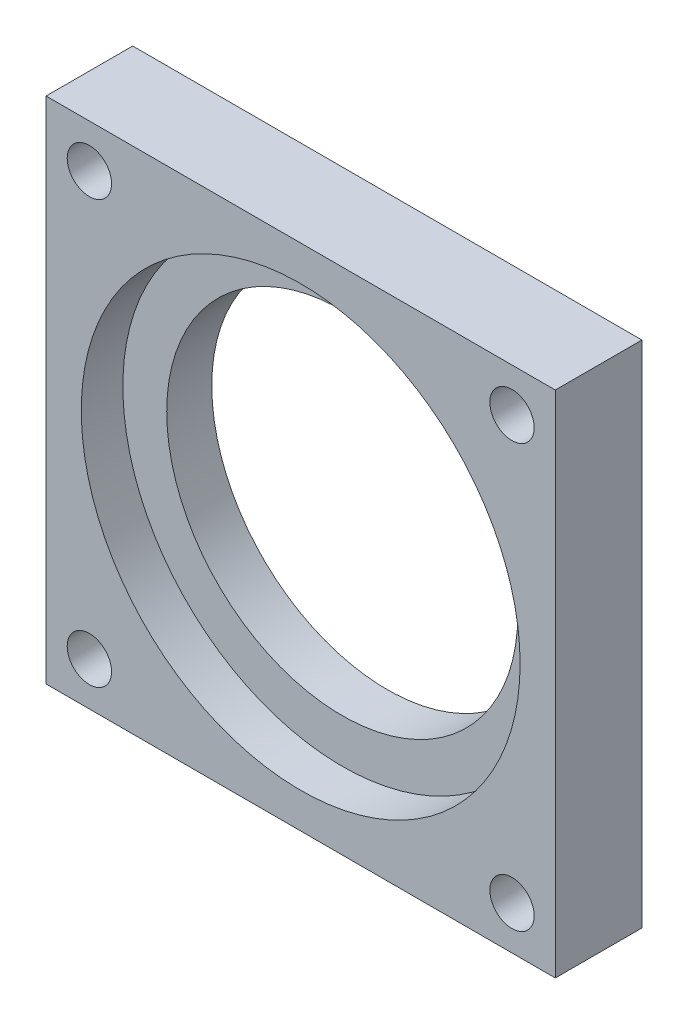
ISO-10303-21;
HEADER;
FILE_DESCRIPTION(('STEP AP214'),'2;1');
FILE_NAME('part.step','',(''),(''),'','','');
FILE_SCHEMA(('AUTOMOTIVE_DESIGN { 1 0 10303 214 1 1 1 1 }'));
ENDSEC;
DATA;
#1=APPLICATION_CONTEXT('core data for automotive mechanical design processes');
#2=APPLICATION_PROTOCOL_DEFINITION('international standard','automotive_design',2000,#1);
#3=PRODUCT_CONTEXT('',#1,'mechanical');
#4=PRODUCT('Part','Part','',(#3));
#5=PRODUCT_RELATED_PRODUCT_CATEGORY('part','',(#4));
#6=PRODUCT_DEFINITION_FORMATION('','',#4);
#7=PRODUCT_DEFINITION_CONTEXT('part definition',#1,'design');
#8=PRODUCT_DEFINITION('design','',#6,#7);
#9=PRODUCT_DEFINITION_SHAPE('','',#8);
#10=(LENGTH_UNIT() NAMED_UNIT(*) SI_UNIT(.MILLI.,.METRE.));
#11=(NAMED_UNIT(*) PLANE_ANGLE_UNIT() SI_UNIT($,.RADIAN.));
#12=(NAMED_UNIT(*) SI_UNIT($,.STERADIAN.) SOLID_ANGLE_UNIT());
#13=UNCERTAINTY_MEASURE_WITH_UNIT(LENGTH_MEASURE(1.E-05),#10,'distance_accuracy_value','');
#14=(GEOMETRIC_REPRESENTATION_CONTEXT(3) GLOBAL_UNCERTAINTY_ASSIGNED_CONTEXT((#13)) GLOBAL_UNIT_ASSIGNED_CONTEXT((#10,
#11,#12)) REPRESENTATION_CONTEXT('',''));
#15=CARTESIAN_POINT('',(0.,0.,0.));
#16=DIRECTION('',(0.,0.,1.));
#17=DIRECTION('',(1.,0.,0.));
#18=AXIS2_PLACEMENT_3D('',#15,#16,#17);
#19=CARTESIAN_POINT('',(13.99999994,-14.,4.7625));
#20=DIRECTION('',(-1.,0.,0.));
#21=DIRECTION('',(0.,0.,1.));
#22=AXIS2_PLACEMENT_3D('',#19,#20,#21);
#23=PLANE('',#22);
#24=DIRECTION('',(0.,1.,0.));
#25=VECTOR('',#24,1.);
#26=CARTESIAN_POINT('',(13.99999994,-14.,0.));
#27=LINE('',#26,#25);
#28=CARTESIAN_POINT('',(13.99999994,-14.,0.));
#29=VERTEX_POINT('',#28);
#30=CARTESIAN_POINT('',(13.99999994,14.,0.));
#31=VERTEX_POINT('',#30);
#32=EDGE_CURVE('E95',#29,#31,#27,.T.);
#33=ORIENTED_EDGE('',*,*,#32,.T.);
#34=DIRECTION('',(0.,0.,-1.));
#35=VECTOR('',#34,1.);
#36=CARTESIAN_POINT('',(13.99999994,14.,4.7625));
#37=LINE('',#36,#35);
#38=CARTESIAN_POINT('',(13.99999994,14.,4.7625));
#39=VERTEX_POINT('',#38);
#40=EDGE_CURVE('E11',#39,#31,#37,.T.);
#41=ORIENTED_EDGE('',*,*,#40,.F.);
#42=DIRECTION('',(0.,1.,0.));
#43=VECTOR('',#42,1.);
#44=CARTESIAN_POINT('',(13.99999994,-14.,4.7625));
#45=LINE('',#44,#43);
#46=CARTESIAN_POINT('',(13.99999994,-14.,4.7625));
#47=VERTEX_POINT('',#46);
#48=EDGE_CURVE('E83',#47,#39,#45,.T.);
#49=ORIENTED_EDGE('',*,*,#48,.F.);
#50=DIRECTION('',(0.,0.,-1.));
#51=VECTOR('',#50,1.);
#52=CARTESIAN_POINT('',(13.99999994,-14.,4.7625));
#53=LINE('',#52,#51);
#54=EDGE_CURVE('E91',#47,#29,#53,.T.);
#55=ORIENTED_EDGE('',*,*,#54,.T.);
#56=EDGE_LOOP('',(#33,#41,#49,#55));
#57=FACE_BOUND('',#56,.T.);
#58=ADVANCED_FACE('F32',(#57),#23,.F.);
#59=CARTESIAN_POINT('',(-13.99999994,14.,4.7625));
#60=DIRECTION('',(0.,-1.,0.));
#61=DIRECTION('',(0.,0.,-1.));
#62=AXIS2_PLACEMENT_3D('',#59,#60,#61);
#63=PLANE('',#62);
#64=DIRECTION('',(-1.,0.,0.));
#65=VECTOR('',#64,1.);
#66=CARTESIAN_POINT('',(-13.99999994,14.,0.));
#67=LINE('',#66,#65);
#68=CARTESIAN_POINT('',(-13.99999994,14.,0.));
#69=VERTEX_POINT('',#68);
#70=EDGE_CURVE('E87',#31,#69,#67,.T.);
#71=ORIENTED_EDGE('',*,*,#70,.T.);
#72=DIRECTION('',(0.,0.,-1.));
#73=VECTOR('',#72,1.);
#74=CARTESIAN_POINT('',(-13.99999994,14.,4.7625));
#75=LINE('',#74,#73);
#76=CARTESIAN_POINT('',(-13.99999994,14.,4.7625));
#77=VERTEX_POINT('',#76);
#78=EDGE_CURVE('E40',#77,#69,#75,.T.);
#79=ORIENTED_EDGE('',*,*,#78,.F.);
#80=DIRECTION('',(-1.,0.,0.));
#81=VECTOR('',#80,1.);
#82=CARTESIAN_POINT('',(-13.99999994,14.,4.7625));
#83=LINE('',#82,#81);
#84=EDGE_CURVE('E78',#39,#77,#83,.T.);
#85=ORIENTED_EDGE('',*,*,#84,.F.);
#86=ORIENTED_EDGE('',*,*,#40,.T.);
#87=EDGE_LOOP('',(#71,#79,#85,#86));
#88=FACE_BOUND('',#87,.T.);
#89=ADVANCED_FACE('F86',(#88),#63,.F.);
#90=CARTESIAN_POINT('',(-13.99999994,-14.,4.7625));
#91=DIRECTION('',(1.,0.,0.));
#92=DIRECTION('',(0.,0.,-1.));
#93=AXIS2_PLACEMENT_3D('',#90,#91,#92);
#94=PLANE('',#93);
#95=DIRECTION('',(0.,-1.,0.));
#96=VECTOR('',#95,1.);
#97=CARTESIAN_POINT('',(-13.99999994,-14.,0.));
#98=LINE('',#97,#96);
#99=CARTESIAN_POINT('',(-13.99999994,-14.,0.));
#100=VERTEX_POINT('',#99);
#101=EDGE_CURVE('E65',#69,#100,#98,.T.);
#102=ORIENTED_EDGE('',*,*,#101,.T.);
#103=DIRECTION('',(0.,0.,-1.));
#104=VECTOR('',#103,1.);
#105=CARTESIAN_POINT('',(-13.99999994,-14.,4.7625));
#106=LINE('',#105,#104);
#107=CARTESIAN_POINT('',(-13.99999994,-14.,4.7625));
#108=VERTEX_POINT('',#107);
#109=EDGE_CURVE('E88',#108,#100,#106,.T.);
#110=ORIENTED_EDGE('',*,*,#109,.F.);
#111=DIRECTION('',(0.,-1.,0.));
#112=VECTOR('',#111,1.);
#113=CARTESIAN_POINT('',(-13.99999994,-14.,4.7625));
#114=LINE('',#113,#112);
#115=EDGE_CURVE('E81',#77,#108,#114,.T.);
#116=ORIENTED_EDGE('',*,*,#115,.F.);
#117=ORIENTED_EDGE('',*,*,#78,.T.);
#118=EDGE_LOOP('',(#102,#110,#116,#117));
#119=FACE_BOUND('',#118,.T.);
#120=ADVANCED_FACE('F89',(#119),#94,.F.);
#121=CARTESIAN_POINT('',(-13.99999994,-14.,4.7625));
#122=DIRECTION('',(0.,1.,0.));
#123=DIRECTION('',(0.,0.,1.));
#124=AXIS2_PLACEMENT_3D('',#121,#122,#123);
#125=PLANE('',#124);
#126=DIRECTION('',(1.,0.,0.));
#127=VECTOR('',#126,1.);
#128=CARTESIAN_POINT('',(-13.99999994,-14.,0.));
#129=LINE('',#128,#127);
#130=EDGE_CURVE('E71',#100,#29,#129,.T.);
#131=ORIENTED_EDGE('',*,*,#130,.T.);
#132=ORIENTED_EDGE('',*,*,#54,.F.);
#133=DIRECTION('',(1.,0.,0.));
#134=VECTOR('',#133,1.);
#135=CARTESIAN_POINT('',(-13.99999994,-14.,4.7625));
#136=LINE('',#135,#134);
#137=EDGE_CURVE('E48',#108,#47,#136,.T.);
#138=ORIENTED_EDGE('',*,*,#137,.F.);
#139=ORIENTED_EDGE('',*,*,#109,.T.);
#140=EDGE_LOOP('',(#131,#132,#138,#139));
#141=FACE_BOUND('',#140,.T.);
#142=ADVANCED_FACE('F103',(#141),#125,.F.);
#143=CARTESIAN_POINT('',(13.99999994,14.,4.7625));
#144=DIRECTION('',(0.,0.,-1.));
#145=DIRECTION('',(-1.,0.,0.));
#146=AXIS2_PLACEMENT_3D('',#143,#144,#145);
#147=PLANE('',#146);
#148=CARTESIAN_POINT('',(-11.61874994,11.61875,4.7625));
#149=DIRECTION('',(0.,0.,-1.));
#150=DIRECTION('',(-1.,0.,0.));
#151=AXIS2_PLACEMENT_3D('',#148,#149,#150);
#152=CIRCLE('',#151,1.2192);
#153=CARTESIAN_POINT('',(-12.83794994,11.61875,4.7625));
#154=VERTEX_POINT('',#153);
#155=EDGE_CURVE('E147',#154,#154,#152,.T.);
#156=ORIENTED_EDGE('',*,*,#155,.T.);
#157=EDGE_LOOP('',(#156));
#158=FACE_BOUND('',#157,.T.);
#159=CARTESIAN_POINT('',(-11.61874994,-11.61875,4.7625));
#160=DIRECTION('',(0.,0.,-1.));
#161=DIRECTION('',(-1.,0.,0.));
#162=AXIS2_PLACEMENT_3D('',#159,#160,#161);
#163=CIRCLE('',#162,1.2192);
#164=CARTESIAN_POINT('',(-12.83794994,-11.61875,4.7625));
#165=VERTEX_POINT('',#164);
#166=EDGE_CURVE('E138',#165,#165,#163,.T.);
#167=ORIENTED_EDGE('',*,*,#166,.T.);
#168=EDGE_LOOP('',(#167));
#169=FACE_BOUND('',#168,.T.);
#170=CARTESIAN_POINT('',(11.61874994,-11.61875,4.7625));
#171=DIRECTION('',(0.,0.,-1.));
#172=DIRECTION('',(-1.,0.,0.));
#173=AXIS2_PLACEMENT_3D('',#170,#171,#172);
#174=CIRCLE('',#173,1.2192);
#175=CARTESIAN_POINT('',(10.39954994,-11.61875,4.7625));
#176=VERTEX_POINT('',#175);
#177=EDGE_CURVE('E129',#176,#176,#174,.T.);
#178=ORIENTED_EDGE('',*,*,#177,.T.);
#179=EDGE_LOOP('',(#178));
#180=FACE_BOUND('',#179,.T.);
#181=CARTESIAN_POINT('',(11.61874994,11.61875,4.7625));
#182=DIRECTION('',(0.,0.,-1.));
#183=DIRECTION('',(-1.,0.,0.));
#184=AXIS2_PLACEMENT_3D('',#181,#182,#183);
#185=CIRCLE('',#184,1.2192);
#186=CARTESIAN_POINT('',(10.39954994,11.61875,4.7625));
#187=VERTEX_POINT('',#186);
#188=EDGE_CURVE('E118',#187,#187,#185,.T.);
#189=ORIENTED_EDGE('',*,*,#188,.T.);
#190=EDGE_LOOP('',(#189));
#191=FACE_BOUND('',#190,.T.);
#192=CARTESIAN_POINT('',(0.,0.,4.7625));
#193=DIRECTION('',(0.,0.,1.));
#194=DIRECTION('',(1.,0.,0.));
#195=AXIS2_PLACEMENT_3D('',#192,#193,#194);
#196=CIRCLE('',#195,12.065);
#197=CARTESIAN_POINT('',(12.065,0.,4.7625));
#198=VERTEX_POINT('',#197);
#199=EDGE_CURVE('E109',#198,#198,#196,.T.);
#200=ORIENTED_EDGE('',*,*,#199,.F.);
#201=EDGE_LOOP('',(#200));
#202=FACE_BOUND('',#201,.T.);
#203=ORIENTED_EDGE('',*,*,#48,.T.);
#204=ORIENTED_EDGE('',*,*,#84,.T.);
#205=ORIENTED_EDGE('',*,*,#115,.T.);
#206=ORIENTED_EDGE('',*,*,#137,.T.);
#207=EDGE_LOOP('',(#203,#204,#205,#206));
#208=FACE_BOUND('',#207,.T.);
#209=ADVANCED_FACE('F79',(#158,#169,#180,#191,#202,#208),#147,.F.);
#210=CARTESIAN_POINT('',(13.99999994,14.,0.));
#211=DIRECTION('',(0.,0.,-1.));
#212=DIRECTION('',(-1.,0.,0.));
#213=AXIS2_PLACEMENT_3D('',#210,#211,#212);
#214=PLANE('',#213);
#215=CARTESIAN_POINT('',(-11.61874994,11.61875,0.));
#216=DIRECTION('',(0.,0.,-1.));
#217=DIRECTION('',(-1.,0.,0.));
#218=AXIS2_PLACEMENT_3D('',#215,#216,#217);
#219=CIRCLE('',#218,2.1844);
#220=CARTESIAN_POINT('',(-13.80314994,11.61875,0.));
#221=VERTEX_POINT('',#220);
#222=EDGE_CURVE('E153',#221,#221,#219,.T.);
#223=ORIENTED_EDGE('',*,*,#222,.F.);
#224=EDGE_LOOP('',(#223));
#225=FACE_BOUND('',#224,.T.);
#226=CARTESIAN_POINT('',(-11.61874994,-11.61875,0.));
#227=DIRECTION('',(0.,0.,-1.));
#228=DIRECTION('',(-1.,0.,0.));
#229=AXIS2_PLACEMENT_3D('',#226,#227,#228);
#230=CIRCLE('',#229,2.1844);
#231=CARTESIAN_POINT('',(-13.80314994,-11.61875,0.));
#232=VERTEX_POINT('',#231);
#233=EDGE_CURVE('E144',#232,#232,#230,.T.);
#234=ORIENTED_EDGE('',*,*,#233,.F.);
#235=EDGE_LOOP('',(#234));
#236=FACE_BOUND('',#235,.T.);
#237=CARTESIAN_POINT('',(11.61874994,-11.61875,0.));
#238=DIRECTION('',(0.,0.,-1.));
#239=DIRECTION('',(-1.,0.,0.));
#240=AXIS2_PLACEMENT_3D('',#237,#238,#239);
#241=CIRCLE('',#240,2.1844);
#242=CARTESIAN_POINT('',(9.43434994,-11.61875,0.));
#243=VERTEX_POINT('',#242);
#244=EDGE_CURVE('E135',#243,#243,#241,.T.);
#245=ORIENTED_EDGE('',*,*,#244,.F.);
#246=EDGE_LOOP('',(#245));
#247=FACE_BOUND('',#246,.T.);
#248=CARTESIAN_POINT('',(11.61874994,11.61875,0.));
#249=DIRECTION('',(0.,0.,-1.));
#250=DIRECTION('',(-1.,0.,0.));
#251=AXIS2_PLACEMENT_3D('',#248,#249,#250);
#252=CIRCLE('',#251,2.1844);
#253=CARTESIAN_POINT('',(9.43434994,11.61875,0.));
#254=VERTEX_POINT('',#253);
#255=EDGE_CURVE('E126',#254,#254,#252,.T.);
#256=ORIENTED_EDGE('',*,*,#255,.F.);
#257=EDGE_LOOP('',(#256));
#258=FACE_BOUND('',#257,.T.);
#259=CARTESIAN_POINT('',(0.,0.,0.));
#260=DIRECTION('',(0.,0.,1.));
#261=DIRECTION('',(1.,0.,0.));
#262=AXIS2_PLACEMENT_3D('',#259,#260,#261);
#263=CIRCLE('',#262,9.652);
#264=CARTESIAN_POINT('',(9.652,0.,0.));
#265=VERTEX_POINT('',#264);
#266=EDGE_CURVE('E112',#265,#265,#263,.T.);
#267=ORIENTED_EDGE('',*,*,#266,.T.);
#268=EDGE_LOOP('',(#267));
#269=FACE_BOUND('',#268,.T.);
#270=ORIENTED_EDGE('',*,*,#32,.F.);
#271=ORIENTED_EDGE('',*,*,#130,.F.);
#272=ORIENTED_EDGE('',*,*,#101,.F.);
#273=ORIENTED_EDGE('',*,*,#70,.F.);
#274=EDGE_LOOP('',(#270,#271,#272,#273));
#275=FACE_BOUND('',#274,.T.);
#276=ADVANCED_FACE('F106',(#225,#236,#247,#258,#269,#275),#214,.T.);
#277=CARTESIAN_POINT('',(0.,0.,2.4765));
#278=DIRECTION('',(0.,0.,1.));
#279=DIRECTION('',(1.,0.,0.));
#280=AXIS2_PLACEMENT_3D('',#277,#278,#279);
#281=CYLINDRICAL_SURFACE('',#280,12.065);
#282=CARTESIAN_POINT('',(0.,0.,2.4765));
#283=DIRECTION('',(0.,0.,1.));
#284=DIRECTION('',(1.,0.,0.));
#285=AXIS2_PLACEMENT_3D('',#282,#283,#284);
#286=CIRCLE('',#285,12.065);
#287=CARTESIAN_POINT('',(12.065,0.,2.4765));
#288=VERTEX_POINT('',#287);
#289=EDGE_CURVE('E98',#288,#288,#286,.T.);
#290=ORIENTED_EDGE('',*,*,#289,.F.);
#291=EDGE_LOOP('',(#290));
#292=FACE_BOUND('',#291,.T.);
#293=ORIENTED_EDGE('',*,*,#199,.T.);
#294=EDGE_LOOP('',(#293));
#295=FACE_BOUND('',#294,.T.);
#296=ADVANCED_FACE('F161',(#292,#295),#281,.F.);
#297=CARTESIAN_POINT('',(0.,0.,2.4765));
#298=DIRECTION('',(0.,0.,1.));
#299=DIRECTION('',(1.,0.,0.));
#300=AXIS2_PLACEMENT_3D('',#297,#298,#299);
#301=PLANE('',#300);
#302=CARTESIAN_POINT('',(0.,0.,2.4765));
#303=DIRECTION('',(0.,0.,1.));
#304=DIRECTION('',(1.,0.,0.));
#305=AXIS2_PLACEMENT_3D('',#302,#303,#304);
#306=CIRCLE('',#305,9.652);
#307=CARTESIAN_POINT('',(9.652,0.,2.4765));
#308=VERTEX_POINT('',#307);
#309=EDGE_CURVE('E115',#308,#308,#306,.T.);
#310=ORIENTED_EDGE('',*,*,#309,.F.);
#311=EDGE_LOOP('',(#310));
#312=FACE_BOUND('',#311,.T.);
#313=ORIENTED_EDGE('',*,*,#289,.T.);
#314=EDGE_LOOP('',(#313));
#315=FACE_BOUND('',#314,.T.);
#316=ADVANCED_FACE('F175',(#312,#315),#301,.T.);
#317=CARTESIAN_POINT('',(0.,0.,0.));
#318=DIRECTION('',(0.,0.,1.));
#319=DIRECTION('',(1.,0.,0.));
#320=AXIS2_PLACEMENT_3D('',#317,#318,#319);
#321=CYLINDRICAL_SURFACE('',#320,9.652);
#322=ORIENTED_EDGE('',*,*,#266,.F.);
#323=EDGE_LOOP('',(#322));
#324=FACE_BOUND('',#323,.T.);
#325=ORIENTED_EDGE('',*,*,#309,.T.);
#326=EDGE_LOOP('',(#325));
#327=FACE_BOUND('',#326,.T.);
#328=ADVANCED_FACE('F171',(#324,#327),#321,.F.);
#329=CARTESIAN_POINT('',(11.61874994,11.61875,0.));
#330=DIRECTION('',(0.,0.,-1.));
#331=DIRECTION('',(-1.,0.,0.));
#332=AXIS2_PLACEMENT_3D('',#329,#330,#331);
#333=CYLINDRICAL_SURFACE('',#332,1.2192);
#334=ORIENTED_EDGE('',*,*,#188,.F.);
#335=EDGE_LOOP('',(#334));
#336=FACE_BOUND('',#335,.T.);
#337=CARTESIAN_POINT('',(11.61874994,11.61875,1.11033558664972));
#338=DIRECTION('',(0.,0.,-1.));
#339=DIRECTION('',(-1.,0.,0.));
#340=AXIS2_PLACEMENT_3D('',#337,#338,#339);
#341=CIRCLE('',#340,1.2192);
#342=CARTESIAN_POINT('',(10.39954994,11.61875,1.11033558664972));
#343=VERTEX_POINT('',#342);
#344=EDGE_CURVE('E123',#343,#343,#341,.T.);
#345=ORIENTED_EDGE('',*,*,#344,.T.);
#346=EDGE_LOOP('',(#345));
#347=FACE_BOUND('',#346,.T.);
#348=ADVANCED_FACE('F174',(#336,#347),#333,.F.);
#349=CARTESIAN_POINT('',(11.61874994,11.61875,0.));
#350=DIRECTION('',(0.,0.,-1.));
#351=DIRECTION('',(-1.,0.,0.));
#352=AXIS2_PLACEMENT_3D('',#349,#350,#351);
#353=CONICAL_SURFACE('',#352,2.1844,0.715584993317675);
#354=ORIENTED_EDGE('',*,*,#344,.F.);
#355=EDGE_LOOP('',(#354));
#356=FACE_BOUND('',#355,.T.);
#357=ORIENTED_EDGE('',*,*,#255,.T.);
#358=EDGE_LOOP('',(#357));
#359=FACE_BOUND('',#358,.T.);
#360=ADVANCED_FACE('F248',(#356,#359),#353,.F.);
#361=CARTESIAN_POINT('',(11.61874994,-11.61875,0.));
#362=DIRECTION('',(0.,0.,-1.));
#363=DIRECTION('',(-1.,0.,0.));
#364=AXIS2_PLACEMENT_3D('',#361,#362,#363);
#365=CYLINDRICAL_SURFACE('',#364,1.2192);
#366=ORIENTED_EDGE('',*,*,#177,.F.);
#367=EDGE_LOOP('',(#366));
#368=FACE_BOUND('',#367,.T.);
#369=CARTESIAN_POINT('',(11.61874994,-11.61875,1.11033558664972));
#370=DIRECTION('',(0.,0.,-1.));
#371=DIRECTION('',(-1.,0.,0.));
#372=AXIS2_PLACEMENT_3D('',#369,#370,#371);
#373=CIRCLE('',#372,1.2192);
#374=CARTESIAN_POINT('',(10.39954994,-11.61875,1.11033558664972));
#375=VERTEX_POINT('',#374);
#376=EDGE_CURVE('E132',#375,#375,#373,.T.);
#377=ORIENTED_EDGE('',*,*,#376,.T.);
#378=EDGE_LOOP('',(#377));
#379=FACE_BOUND('',#378,.T.);
#380=ADVANCED_FACE('F258',(#368,#379),#365,.F.);
#381=CARTESIAN_POINT('',(11.61874994,-11.61875,0.));
#382=DIRECTION('',(0.,0.,-1.));
#383=DIRECTION('',(-1.,0.,0.));
#384=AXIS2_PLACEMENT_3D('',#381,#382,#383);
#385=CONICAL_SURFACE('',#384,2.1844,0.715584993317675);
#386=ORIENTED_EDGE('',*,*,#376,.F.);
#387=EDGE_LOOP('',(#386));
#388=FACE_BOUND('',#387,.T.);
#389=ORIENTED_EDGE('',*,*,#244,.T.);
#390=EDGE_LOOP('',(#389));
#391=FACE_BOUND('',#390,.T.);
#392=ADVANCED_FACE('F268',(#388,#391),#385,.F.);
#393=CARTESIAN_POINT('',(-11.61874994,-11.61875,0.));
#394=DIRECTION('',(0.,0.,-1.));
#395=DIRECTION('',(-1.,0.,0.));
#396=AXIS2_PLACEMENT_3D('',#393,#394,#395);
#397=CYLINDRICAL_SURFACE('',#396,1.2192);
#398=ORIENTED_EDGE('',*,*,#166,.F.);
#399=EDGE_LOOP('',(#398));
#400=FACE_BOUND('',#399,.T.);
#401=CARTESIAN_POINT('',(-11.61874994,-11.61875,1.11033558664972));
#402=DIRECTION('',(0.,0.,-1.));
#403=DIRECTION('',(-1.,0.,0.));
#404=AXIS2_PLACEMENT_3D('',#401,#402,#403);
#405=CIRCLE('',#404,1.2192);
#406=CARTESIAN_POINT('',(-12.83794994,-11.61875,1.11033558664972));
#407=VERTEX_POINT('',#406);
#408=EDGE_CURVE('E141',#407,#407,#405,.T.);
#409=ORIENTED_EDGE('',*,*,#408,.T.);
#410=EDGE_LOOP('',(#409));
#411=FACE_BOUND('',#410,.T.);
#412=ADVANCED_FACE('F278',(#400,#411),#397,.F.);
#413=CARTESIAN_POINT('',(-11.61874994,-11.61875,0.));
#414=DIRECTION('',(0.,0.,-1.));
#415=DIRECTION('',(-1.,0.,0.));
#416=AXIS2_PLACEMENT_3D('',#413,#414,#415);
#417=CONICAL_SURFACE('',#416,2.1844,0.715584993317675);
#418=ORIENTED_EDGE('',*,*,#408,.F.);
#419=EDGE_LOOP('',(#418));
#420=FACE_BOUND('',#419,.T.);
#421=ORIENTED_EDGE('',*,*,#233,.T.);
#422=EDGE_LOOP('',(#421));
#423=FACE_BOUND('',#422,.T.);
#424=ADVANCED_FACE('F288',(#420,#423),#417,.F.);
#425=CARTESIAN_POINT('',(-11.61874994,11.61875,0.));
#426=DIRECTION('',(0.,0.,-1.));
#427=DIRECTION('',(-1.,0.,0.));
#428=AXIS2_PLACEMENT_3D('',#425,#426,#427);
#429=CYLINDRICAL_SURFACE('',#428,1.2192);
#430=ORIENTED_EDGE('',*,*,#155,.F.);
#431=EDGE_LOOP('',(#430));
#432=FACE_BOUND('',#431,.T.);
#433=CARTESIAN_POINT('',(-11.61874994,11.61875,1.11033558664972));
#434=DIRECTION('',(0.,0.,-1.));
#435=DIRECTION('',(-1.,0.,0.));
#436=AXIS2_PLACEMENT_3D('',#433,#434,#435);
#437=CIRCLE('',#436,1.2192);
#438=CARTESIAN_POINT('',(-12.83794994,11.61875,1.11033558664972));
#439=VERTEX_POINT('',#438);
#440=EDGE_CURVE('E150',#439,#439,#437,.T.);
#441=ORIENTED_EDGE('',*,*,#440,.T.);
#442=EDGE_LOOP('',(#441));
#443=FACE_BOUND('',#442,.T.);
#444=ADVANCED_FACE('F298',(#432,#443),#429,.F.);
#445=CARTESIAN_POINT('',(-11.61874994,11.61875,0.));
#446=DIRECTION('',(0.,0.,-1.));
#447=DIRECTION('',(-1.,0.,0.));
#448=AXIS2_PLACEMENT_3D('',#445,#446,#447);
#449=CONICAL_SURFACE('',#448,2.1844,0.715584993317675);
#450=ORIENTED_EDGE('',*,*,#440,.F.);
#451=EDGE_LOOP('',(#450));
#452=FACE_BOUND('',#451,.T.);
#453=ORIENTED_EDGE('',*,*,#222,.T.);
#454=EDGE_LOOP('',(#453));
#455=FACE_BOUND('',#454,.T.);
#456=ADVANCED_FACE('F157',(#452,#455),#449,.F.);
#457=CLOSED_SHELL('',(#58,#89,#120,#142,#209,#276,#296,#316,#328,#348,#360,#380,#392,#412,#424,
#444,#456));
#458=MANIFOLD_SOLID_BREP('B2',#457);
#459=ADVANCED_BREP_SHAPE_REPRESENTATION('',(#18,#458),#14);
#460=SHAPE_DEFINITION_REPRESENTATION(#9,#459);
ENDSEC;
END-ISO-10303-21;
